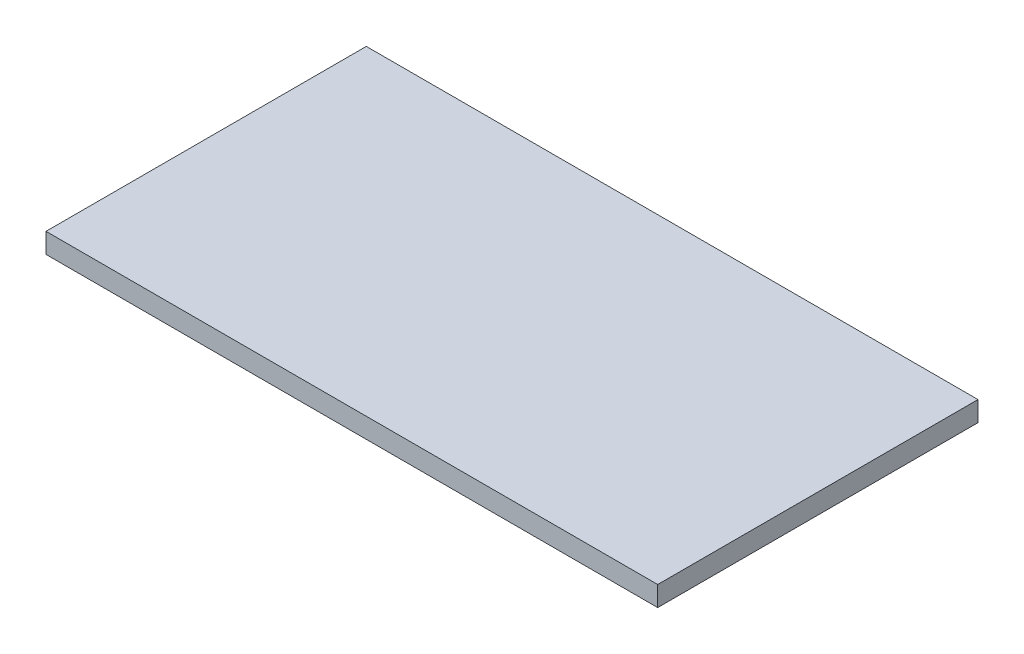
ISO-10303-21;
HEADER;
FILE_DESCRIPTION(('STEP AP214'),'2;1');
FILE_NAME('part.step','',(''),(''),'','','');
FILE_SCHEMA(('AUTOMOTIVE_DESIGN { 1 0 10303 214 1 1 1 1 }'));
ENDSEC;
DATA;
#1=APPLICATION_CONTEXT('core data for automotive mechanical design processes');
#2=APPLICATION_PROTOCOL_DEFINITION('international standard','automotive_design',2000,#1);
#3=PRODUCT_CONTEXT('',#1,'mechanical');
#4=PRODUCT('Part','Part','',(#3));
#5=PRODUCT_RELATED_PRODUCT_CATEGORY('part','',(#4));
#6=PRODUCT_DEFINITION_FORMATION('','',#4);
#7=PRODUCT_DEFINITION_CONTEXT('part definition',#1,'design');
#8=PRODUCT_DEFINITION('design','',#6,#7);
#9=PRODUCT_DEFINITION_SHAPE('','',#8);
#10=(LENGTH_UNIT() NAMED_UNIT(*) SI_UNIT(.MILLI.,.METRE.));
#11=(NAMED_UNIT(*) PLANE_ANGLE_UNIT() SI_UNIT($,.RADIAN.));
#12=(NAMED_UNIT(*) SI_UNIT($,.STERADIAN.) SOLID_ANGLE_UNIT());
#13=UNCERTAINTY_MEASURE_WITH_UNIT(LENGTH_MEASURE(1.E-05),#10,'distance_accuracy_value','');
#14=(GEOMETRIC_REPRESENTATION_CONTEXT(3) GLOBAL_UNCERTAINTY_ASSIGNED_CONTEXT((#13)) GLOBAL_UNIT_ASSIGNED_CONTEXT((#10,
#11,#12)) REPRESENTATION_CONTEXT('',''));
#15=CARTESIAN_POINT('',(0.,0.,0.));
#16=DIRECTION('',(0.,0.,1.));
#17=DIRECTION('',(1.,0.,0.));
#18=AXIS2_PLACEMENT_3D('',#15,#16,#17);
#19=CARTESIAN_POINT('',(-275.,18.,144.));
#20=DIRECTION('',(1.,0.,0.));
#21=DIRECTION('',(0.,0.,-1.));
#22=AXIS2_PLACEMENT_3D('',#19,#20,#21);
#23=PLANE('',#22);
#24=DIRECTION('',(0.,0.,1.));
#25=VECTOR('',#24,1.);
#26=CARTESIAN_POINT('',(-275.,0.,144.));
#27=LINE('',#26,#25);
#28=CARTESIAN_POINT('',(-275.,0.,-144.));
#29=VERTEX_POINT('',#28);
#30=CARTESIAN_POINT('',(-275.,0.,144.));
#31=VERTEX_POINT('',#30);
#32=EDGE_CURVE('E96',#29,#31,#27,.T.);
#33=ORIENTED_EDGE('',*,*,#32,.T.);
#34=DIRECTION('',(0.,-1.,0.));
#35=VECTOR('',#34,1.);
#36=CARTESIAN_POINT('',(-275.,18.,144.));
#37=LINE('',#36,#35);
#38=CARTESIAN_POINT('',(-275.,18.,144.));
#39=VERTEX_POINT('',#38);
#40=EDGE_CURVE('E11',#39,#31,#37,.T.);
#41=ORIENTED_EDGE('',*,*,#40,.F.);
#42=DIRECTION('',(0.,0.,1.));
#43=VECTOR('',#42,1.);
#44=CARTESIAN_POINT('',(-275.,18.,144.));
#45=LINE('',#44,#43);
#46=CARTESIAN_POINT('',(-275.,18.,-144.));
#47=VERTEX_POINT('',#46);
#48=EDGE_CURVE('E84',#47,#39,#45,.T.);
#49=ORIENTED_EDGE('',*,*,#48,.F.);
#50=DIRECTION('',(0.,-1.,0.));
#51=VECTOR('',#50,1.);
#52=CARTESIAN_POINT('',(-275.,18.,-144.));
#53=LINE('',#52,#51);
#54=EDGE_CURVE('E92',#47,#29,#53,.T.);
#55=ORIENTED_EDGE('',*,*,#54,.T.);
#56=EDGE_LOOP('',(#33,#41,#49,#55));
#57=FACE_BOUND('',#56,.T.);
#58=ADVANCED_FACE('F33',(#57),#23,.F.);
#59=CARTESIAN_POINT('',(275.,18.,144.));
#60=DIRECTION('',(0.,0.,-1.));
#61=DIRECTION('',(-1.,0.,0.));
#62=AXIS2_PLACEMENT_3D('',#59,#60,#61);
#63=PLANE('',#62);
#64=DIRECTION('',(1.,0.,0.));
#65=VECTOR('',#64,1.);
#66=CARTESIAN_POINT('',(275.,0.,144.));
#67=LINE('',#66,#65);
#68=CARTESIAN_POINT('',(275.,0.,144.));
#69=VERTEX_POINT('',#68);
#70=EDGE_CURVE('E88',#31,#69,#67,.T.);
#71=ORIENTED_EDGE('',*,*,#70,.T.);
#72=DIRECTION('',(0.,-1.,0.));
#73=VECTOR('',#72,1.);
#74=CARTESIAN_POINT('',(275.,18.,144.));
#75=LINE('',#74,#73);
#76=CARTESIAN_POINT('',(275.,18.,144.));
#77=VERTEX_POINT('',#76);
#78=EDGE_CURVE('E41',#77,#69,#75,.T.);
#79=ORIENTED_EDGE('',*,*,#78,.F.);
#80=DIRECTION('',(1.,0.,0.));
#81=VECTOR('',#80,1.);
#82=CARTESIAN_POINT('',(275.,18.,144.));
#83=LINE('',#82,#81);
#84=EDGE_CURVE('E79',#39,#77,#83,.T.);
#85=ORIENTED_EDGE('',*,*,#84,.F.);
#86=ORIENTED_EDGE('',*,*,#40,.T.);
#87=EDGE_LOOP('',(#71,#79,#85,#86));
#88=FACE_BOUND('',#87,.T.);
#89=ADVANCED_FACE('F87',(#88),#63,.F.);
#90=CARTESIAN_POINT('',(275.,18.,144.));
#91=DIRECTION('',(-1.,0.,0.));
#92=DIRECTION('',(0.,0.,1.));
#93=AXIS2_PLACEMENT_3D('',#90,#91,#92);
#94=PLANE('',#93);
#95=DIRECTION('',(0.,0.,-1.));
#96=VECTOR('',#95,1.);
#97=CARTESIAN_POINT('',(275.,0.,144.));
#98=LINE('',#97,#96);
#99=CARTESIAN_POINT('',(275.,0.,-144.));
#100=VERTEX_POINT('',#99);
#101=EDGE_CURVE('E66',#69,#100,#98,.T.);
#102=ORIENTED_EDGE('',*,*,#101,.T.);
#103=DIRECTION('',(0.,-1.,0.));
#104=VECTOR('',#103,1.);
#105=CARTESIAN_POINT('',(275.,18.,-144.));
#106=LINE('',#105,#104);
#107=CARTESIAN_POINT('',(275.,18.,-144.));
#108=VERTEX_POINT('',#107);
#109=EDGE_CURVE('E89',#108,#100,#106,.T.);
#110=ORIENTED_EDGE('',*,*,#109,.F.);
#111=DIRECTION('',(0.,0.,-1.));
#112=VECTOR('',#111,1.);
#113=CARTESIAN_POINT('',(275.,18.,144.));
#114=LINE('',#113,#112);
#115=EDGE_CURVE('E82',#77,#108,#114,.T.);
#116=ORIENTED_EDGE('',*,*,#115,.F.);
#117=ORIENTED_EDGE('',*,*,#78,.T.);
#118=EDGE_LOOP('',(#102,#110,#116,#117));
#119=FACE_BOUND('',#118,.T.);
#120=ADVANCED_FACE('F90',(#119),#94,.F.);
#121=CARTESIAN_POINT('',(275.,18.,-144.));
#122=DIRECTION('',(0.,0.,1.));
#123=DIRECTION('',(1.,0.,0.));
#124=AXIS2_PLACEMENT_3D('',#121,#122,#123);
#125=PLANE('',#124);
#126=DIRECTION('',(-1.,0.,0.));
#127=VECTOR('',#126,1.);
#128=CARTESIAN_POINT('',(275.,0.,-144.));
#129=LINE('',#128,#127);
#130=EDGE_CURVE('E72',#100,#29,#129,.T.);
#131=ORIENTED_EDGE('',*,*,#130,.T.);
#132=ORIENTED_EDGE('',*,*,#54,.F.);
#133=DIRECTION('',(-1.,0.,0.));
#134=VECTOR('',#133,1.);
#135=CARTESIAN_POINT('',(275.,18.,-144.));
#136=LINE('',#135,#134);
#137=EDGE_CURVE('E49',#108,#47,#136,.T.);
#138=ORIENTED_EDGE('',*,*,#137,.F.);
#139=ORIENTED_EDGE('',*,*,#109,.T.);
#140=EDGE_LOOP('',(#131,#132,#138,#139));
#141=FACE_BOUND('',#140,.T.);
#142=ADVANCED_FACE('F103',(#141),#125,.F.);
#143=CARTESIAN_POINT('',(0.,18.,0.));
#144=DIRECTION('',(0.,1.,0.));
#145=DIRECTION('',(0.,0.,1.));
#146=AXIS2_PLACEMENT_3D('',#143,#144,#145);
#147=PLANE('',#146);
#148=ORIENTED_EDGE('',*,*,#48,.T.);
#149=ORIENTED_EDGE('',*,*,#84,.T.);
#150=ORIENTED_EDGE('',*,*,#115,.T.);
#151=ORIENTED_EDGE('',*,*,#137,.T.);
#152=EDGE_LOOP('',(#148,#149,#150,#151));
#153=FACE_BOUND('',#152,.T.);
#154=ADVANCED_FACE('F80',(#153),#147,.T.);
#155=CARTESIAN_POINT('',(0.,0.,0.));
#156=DIRECTION('',(0.,1.,0.));
#157=DIRECTION('',(0.,0.,1.));
#158=AXIS2_PLACEMENT_3D('',#155,#156,#157);
#159=PLANE('',#158);
#160=ORIENTED_EDGE('',*,*,#32,.F.);
#161=ORIENTED_EDGE('',*,*,#130,.F.);
#162=ORIENTED_EDGE('',*,*,#101,.F.);
#163=ORIENTED_EDGE('',*,*,#70,.F.);
#164=EDGE_LOOP('',(#160,#161,#162,#163));
#165=FACE_BOUND('',#164,.T.);
#166=ADVANCED_FACE('F106',(#165),#159,.F.);
#167=CLOSED_SHELL('',(#58,#89,#120,#142,#154,#166));
#168=MANIFOLD_SOLID_BREP('B2',#167);
#169=ADVANCED_BREP_SHAPE_REPRESENTATION('',(#18,#168),#14);
#170=SHAPE_DEFINITION_REPRESENTATION(#9,#169);
ENDSEC;
END-ISO-10303-21;
